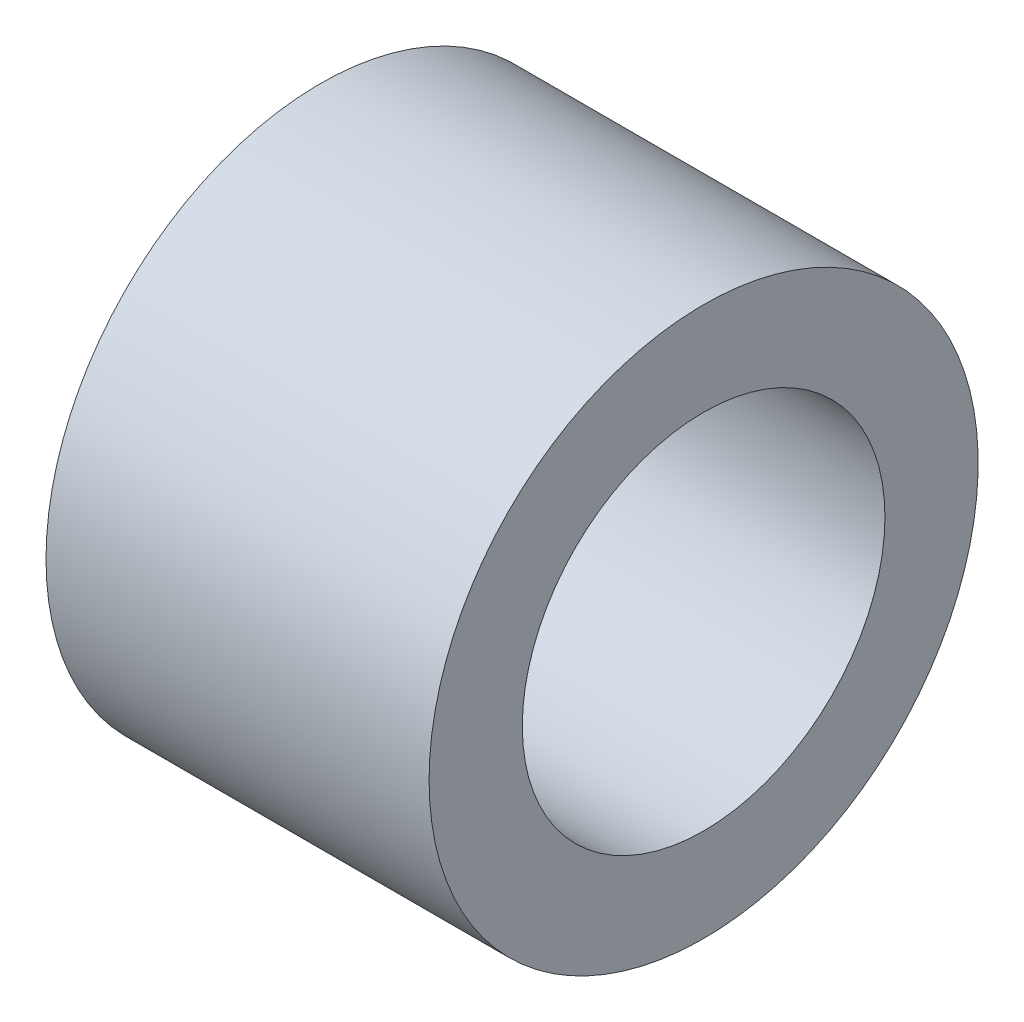
ISO-10303-21;
HEADER;
FILE_DESCRIPTION(('STEP AP214'),'2;1');
FILE_NAME('part.step','',(''),(''),'','','');
FILE_SCHEMA(('AUTOMOTIVE_DESIGN { 1 0 10303 214 1 1 1 1 }'));
ENDSEC;
DATA;
#1=APPLICATION_CONTEXT('core data for automotive mechanical design processes');
#2=APPLICATION_PROTOCOL_DEFINITION('international standard','automotive_design',2000,#1);
#3=PRODUCT_CONTEXT('',#1,'mechanical');
#4=PRODUCT('Part','Part','',(#3));
#5=PRODUCT_RELATED_PRODUCT_CATEGORY('part','',(#4));
#6=PRODUCT_DEFINITION_FORMATION('','',#4);
#7=PRODUCT_DEFINITION_CONTEXT('part definition',#1,'design');
#8=PRODUCT_DEFINITION('design','',#6,#7);
#9=PRODUCT_DEFINITION_SHAPE('','',#8);
#10=(LENGTH_UNIT() NAMED_UNIT(*) SI_UNIT(.MILLI.,.METRE.));
#11=(NAMED_UNIT(*) PLANE_ANGLE_UNIT() SI_UNIT($,.RADIAN.));
#12=(NAMED_UNIT(*) SI_UNIT($,.STERADIAN.) SOLID_ANGLE_UNIT());
#13=UNCERTAINTY_MEASURE_WITH_UNIT(LENGTH_MEASURE(1.E-05),#10,'distance_accuracy_value','');
#14=(GEOMETRIC_REPRESENTATION_CONTEXT(3) GLOBAL_UNCERTAINTY_ASSIGNED_CONTEXT((#13)) GLOBAL_UNIT_ASSIGNED_CONTEXT((#10,
#11,#12)) REPRESENTATION_CONTEXT('',''));
#15=CARTESIAN_POINT('',(0.,0.,0.));
#16=DIRECTION('',(0.,0.,1.));
#17=DIRECTION('',(1.,0.,0.));
#18=AXIS2_PLACEMENT_3D('',#15,#16,#17);
#19=CARTESIAN_POINT('',(-14.114021,7.09999999999999,0.));
#20=DIRECTION('',(1.,0.,0.));
#21=DIRECTION('',(0.,0.,-1.));
#22=AXIS2_PLACEMENT_3D('',#19,#20,#21);
#23=PLANE('',#22);
#24=CARTESIAN_POINT('',(-14.114021,0.,0.));
#25=DIRECTION('',(-1.,0.,0.));
#26=DIRECTION('',(0.,0.,1.));
#27=AXIS2_PLACEMENT_3D('',#24,#25,#26);
#28=CIRCLE('',#27,7.09999999999999);
#29=CARTESIAN_POINT('',(-14.114021,0.,7.09999999999999));
#30=VERTEX_POINT('',#29);
#31=EDGE_CURVE('E45',#30,#30,#28,.T.);
#32=ORIENTED_EDGE('',*,*,#31,.F.);
#33=EDGE_LOOP('',(#32));
#34=FACE_BOUND('',#33,.T.);
#35=CARTESIAN_POINT('',(-14.114021,0.,0.));
#36=DIRECTION('',(-1.,0.,0.));
#37=DIRECTION('',(0.,0.,1.));
#38=AXIS2_PLACEMENT_3D('',#35,#36,#37);
#39=CIRCLE('',#38,10.75);
#40=CARTESIAN_POINT('',(-14.114021,0.,10.75));
#41=VERTEX_POINT('',#40);
#42=EDGE_CURVE('E10',#41,#41,#39,.T.);
#43=ORIENTED_EDGE('',*,*,#42,.T.);
#44=EDGE_LOOP('',(#43));
#45=FACE_BOUND('',#44,.T.);
#46=ADVANCED_FACE('F31',(#34,#45),#23,.F.);
#47=CARTESIAN_POINT('',(-32.8367010309278,0.,0.));
#48=DIRECTION('',(-1.,0.,0.));
#49=DIRECTION('',(0.,0.,1.));
#50=AXIS2_PLACEMENT_3D('',#47,#48,#49);
#51=CYLINDRICAL_SURFACE('',#50,10.75);
#52=ORIENTED_EDGE('',*,*,#42,.F.);
#53=EDGE_LOOP('',(#52));
#54=FACE_BOUND('',#53,.T.);
#55=CARTESIAN_POINT('',(0.885979000000002,0.,0.));
#56=DIRECTION('',(-1.,0.,0.));
#57=DIRECTION('',(0.,0.,1.));
#58=AXIS2_PLACEMENT_3D('',#55,#56,#57);
#59=CIRCLE('',#58,10.75);
#60=CARTESIAN_POINT('',(0.885979000000002,0.,10.75));
#61=VERTEX_POINT('',#60);
#62=EDGE_CURVE('E37',#61,#61,#59,.T.);
#63=ORIENTED_EDGE('',*,*,#62,.T.);
#64=EDGE_LOOP('',(#63));
#65=FACE_BOUND('',#64,.T.);
#66=ADVANCED_FACE('F54',(#54,#65),#51,.T.);
#67=CARTESIAN_POINT('',(0.885979000000003,10.75,0.));
#68=DIRECTION('',(-1.,0.,0.));
#69=DIRECTION('',(0.,0.,1.));
#70=AXIS2_PLACEMENT_3D('',#67,#68,#69);
#71=PLANE('',#70);
#72=ORIENTED_EDGE('',*,*,#62,.F.);
#73=EDGE_LOOP('',(#72));
#74=FACE_BOUND('',#73,.T.);
#75=CARTESIAN_POINT('',(0.885979000000009,0.,0.));
#76=DIRECTION('',(-1.,0.,0.));
#77=DIRECTION('',(0.,0.,1.));
#78=AXIS2_PLACEMENT_3D('',#75,#76,#77);
#79=CIRCLE('',#78,7.1);
#80=CARTESIAN_POINT('',(0.885979000000009,0.,7.1));
#81=VERTEX_POINT('',#80);
#82=EDGE_CURVE('E41',#81,#81,#79,.T.);
#83=ORIENTED_EDGE('',*,*,#82,.T.);
#84=EDGE_LOOP('',(#83));
#85=FACE_BOUND('',#84,.T.);
#86=ADVANCED_FACE('F58',(#74,#85),#71,.F.);
#87=CARTESIAN_POINT('',(-32.8367010309278,0.,0.));
#88=DIRECTION('',(-1.,0.,0.));
#89=DIRECTION('',(0.,0.,1.));
#90=AXIS2_PLACEMENT_3D('',#87,#88,#89);
#91=CYLINDRICAL_SURFACE('',#90,7.1);
#92=ORIENTED_EDGE('',*,*,#82,.F.);
#93=EDGE_LOOP('',(#92));
#94=FACE_BOUND('',#93,.T.);
#95=ORIENTED_EDGE('',*,*,#31,.T.);
#96=EDGE_LOOP('',(#95));
#97=FACE_BOUND('',#96,.T.);
#98=ADVANCED_FACE('F51',(#94,#97),#91,.F.);
#99=CLOSED_SHELL('',(#46,#66,#86,#98));
#100=MANIFOLD_SOLID_BREP('B2',#99);
#101=ADVANCED_BREP_SHAPE_REPRESENTATION('',(#18,#100),#14);
#102=SHAPE_DEFINITION_REPRESENTATION(#9,#101);
ENDSEC;
END-ISO-10303-21;
